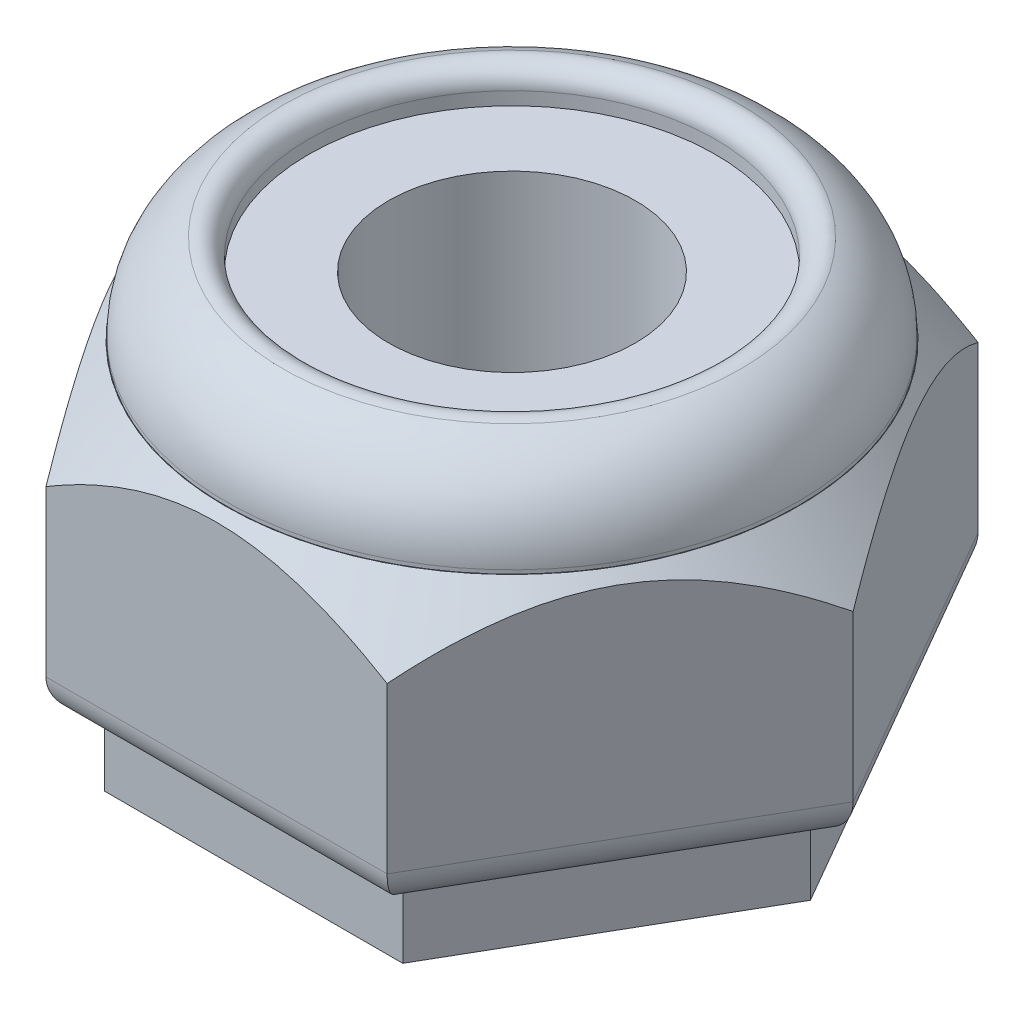
ISO-10303-21;
HEADER;
FILE_DESCRIPTION(('STEP AP214'),'2;1');
FILE_NAME('part.step','',(''),(''),'','','');
FILE_SCHEMA(('AUTOMOTIVE_DESIGN { 1 0 10303 214 1 1 1 1 }'));
ENDSEC;
DATA;
#1=APPLICATION_CONTEXT('core data for automotive mechanical design processes');
#2=APPLICATION_PROTOCOL_DEFINITION('international standard','automotive_design',2000,#1);
#3=PRODUCT_CONTEXT('',#1,'mechanical');
#4=PRODUCT('Part','Part','',(#3));
#5=PRODUCT_RELATED_PRODUCT_CATEGORY('part','',(#4));
#6=PRODUCT_DEFINITION_FORMATION('','',#4);
#7=PRODUCT_DEFINITION_CONTEXT('part definition',#1,'design');
#8=PRODUCT_DEFINITION('design','',#6,#7);
#9=PRODUCT_DEFINITION_SHAPE('','',#8);
#10=(LENGTH_UNIT() NAMED_UNIT(*) SI_UNIT(.MILLI.,.METRE.));
#11=(NAMED_UNIT(*) PLANE_ANGLE_UNIT() SI_UNIT($,.RADIAN.));
#12=(NAMED_UNIT(*) SI_UNIT($,.STERADIAN.) SOLID_ANGLE_UNIT());
#13=UNCERTAINTY_MEASURE_WITH_UNIT(LENGTH_MEASURE(1.E-05),#10,'distance_accuracy_value','');
#14=(GEOMETRIC_REPRESENTATION_CONTEXT(3) GLOBAL_UNCERTAINTY_ASSIGNED_CONTEXT((#13)) GLOBAL_UNIT_ASSIGNED_CONTEXT((#10,
#11,#12)) REPRESENTATION_CONTEXT('',''));
#15=CARTESIAN_POINT('',(0.,0.,0.));
#16=DIRECTION('',(0.,0.,1.));
#17=DIRECTION('',(1.,0.,0.));
#18=AXIS2_PLACEMENT_3D('',#15,#16,#17);
#19=CARTESIAN_POINT('',(0.,4.97840000000001,0.));
#20=DIRECTION('',(0.,-1.,0.));
#21=DIRECTION('',(1.,0.,0.));
#22=AXIS2_PLACEMENT_3D('',#19,#20,#21);
#23=CYLINDRICAL_SURFACE('',#22,3.93700000000001);
#24=CARTESIAN_POINT('',(0.,3.7084,0.));
#25=DIRECTION('',(0.,1.,0.));
#26=DIRECTION('',(-1.,0.,0.));
#27=AXIS2_PLACEMENT_3D('',#24,#25,#26);
#28=CIRCLE('',#27,3.937);
#29=CARTESIAN_POINT('',(-3.937,3.7084,0.));
#30=VERTEX_POINT('',#29);
#31=EDGE_CURVE('E142',#30,#30,#28,.T.);
#32=ORIENTED_EDGE('',*,*,#31,.F.);
#33=EDGE_LOOP('',(#32));
#34=FACE_BOUND('',#33,.T.);
#35=CARTESIAN_POINT('',(0.,3.6576,0.));
#36=DIRECTION('',(0.,-1.,0.));
#37=DIRECTION('',(1.,0.,0.));
#38=AXIS2_PLACEMENT_3D('',#35,#36,#37);
#39=CIRCLE('',#38,3.93700000000001);
#40=CARTESIAN_POINT('',(3.93700000000001,3.6576,0.));
#41=VERTEX_POINT('',#40);
#42=EDGE_CURVE('E20',#41,#41,#39,.F.);
#43=ORIENTED_EDGE('',*,*,#42,.T.);
#44=EDGE_LOOP('',(#43));
#45=FACE_BOUND('',#44,.T.);
#46=ADVANCED_FACE('F16',(#34,#45),#23,.T.);
#47=CARTESIAN_POINT('',(2.34315000000001,3.6576,4.05845484975502));
#48=DIRECTION('',(0.,-1.,0.));
#49=DIRECTION('',(1.,0.,0.));
#50=AXIS2_PLACEMENT_3D('',#47,#48,#49);
#51=PLANE('',#50);
#52=CARTESIAN_POINT('',(0.,3.65760000016735,0.));
#53=DIRECTION('',(0.,-1.,0.));
#54=DIRECTION('',(0.,0.,-1.));
#55=AXIS2_PLACEMENT_3D('',#52,#53,#54);
#56=CIRCLE('',#55,3.94407100938664);
#57=CARTESIAN_POINT('',(0.,3.65760000016735,-3.94407100938664));
#58=VERTEX_POINT('',#57);
#59=EDGE_CURVE('E141',#58,#58,#56,.T.);
#60=ORIENTED_EDGE('',*,*,#59,.F.);
#61=EDGE_LOOP('',(#60));
#62=FACE_BOUND('',#61,.T.);
#63=ORIENTED_EDGE('',*,*,#42,.F.);
#64=EDGE_LOOP('',(#63));
#65=FACE_BOUND('',#64,.T.);
#66=ADVANCED_FACE('F198',(#62,#65),#51,.F.);
#67=CARTESIAN_POINT('',(0.,3.70840000000008,0.));
#68=DIRECTION('',(0.,1.,0.));
#69=DIRECTION('',(0.,0.,1.));
#70=AXIS2_PLACEMENT_3D('',#67,#68,#69);
#71=TOROIDAL_SURFACE('',#70,2.66699999999999,1.27000000000001);
#72=ORIENTED_EDGE('',*,*,#31,.T.);
#73=EDGE_LOOP('',(#72));
#74=FACE_BOUND('',#73,.T.);
#75=CARTESIAN_POINT('',(0.,4.88572150982652,0.));
#76=DIRECTION('',(0.,1.,0.));
#77=DIRECTION('',(-1.,0.,0.));
#78=AXIS2_PLACEMENT_3D('',#75,#76,#77);
#79=CIRCLE('',#78,3.14325000000004);
#80=CARTESIAN_POINT('',(-3.14325000000003,4.88572150982652,0.));
#81=VERTEX_POINT('',#80);
#82=EDGE_CURVE('E121',#81,#81,#79,.T.);
#83=ORIENTED_EDGE('',*,*,#82,.F.);
#84=EDGE_LOOP('',(#83));
#85=FACE_BOUND('',#84,.T.);
#86=ADVANCED_FACE('F195',(#74,#85),#71,.T.);
#87=CARTESIAN_POINT('',(0.,2.76773860986168,0.));
#88=DIRECTION('',(0.,-1.,0.));
#89=DIRECTION('',(0.,0.,-1.));
#90=AXIS2_PLACEMENT_3D('',#87,#88,#89);
#91=CONICAL_SURFACE('',#90,4.69075337383629,0.698131700827581);
#92=CARTESIAN_POINT('',(-4.68630000002063,2.77304593408968,-5.5851817155357E-11));
#93=CARTESIAN_POINT('',(-4.65177717141987,2.81418235899122,0.0597952931143583));
#94=CARTESIAN_POINT('',(-4.61695780288894,2.85432113120693,0.120104208502788));
#95=CARTESIAN_POINT('',(-4.54666264441,2.93230661030783,0.241858994518482));
#96=CARTESIAN_POINT('',(-4.51118655193937,2.9701522247184,0.303305389130307));
#97=CARTESIAN_POINT('',(-4.40329561884235,3.0801870150985,0.490177966928205));
#98=CARTESIAN_POINT('',(-4.32983334003035,3.14837015585763,0.617418366271436));
#99=CARTESIAN_POINT('',(-4.17977964995295,3.27092778618679,0.877318981349457));
#100=CARTESIAN_POINT('',(-4.10317943930135,3.32525984895606,1.00999443806823));
#101=CARTESIAN_POINT('',(-3.94747591648453,3.41577217654512,1.2796808505042));
#102=CARTESIAN_POINT('',(-3.86837998240626,3.45200143021415,1.41667902699998));
#103=CARTESIAN_POINT('',(-3.73746585192525,3.49372811251008,1.64342895242181));
#104=CARTESIAN_POINT('',(-3.68614686015525,3.50560413722607,1.73231605356066));
#105=CARTESIAN_POINT('',(-3.58316406703978,3.52008140709636,1.910687483542));
#106=CARTESIAN_POINT('',(-3.53150020829175,3.52268106759616,2.00017191180866));
#107=CARTESIAN_POINT('',(-3.4285503454563,3.51847006530652,2.1784863048719));
#108=CARTESIAN_POINT('',(-3.37726380879505,3.51171021123823,2.26731719211343));
#109=CARTESIAN_POINT('',(-3.27519197702569,3.48921023560211,2.44411079075957));
#110=CARTESIAN_POINT('',(-3.224406707084,3.47346966546141,2.53207345857468));
#111=CARTESIAN_POINT('',(-3.10963060126893,3.42817062225528,2.73087150534129));
#112=CARTESIAN_POINT('',(-3.04589899568911,3.39598542078789,2.84125788425347));
#113=CARTESIAN_POINT('',(-2.92018166730183,3.32004827847368,3.05900668441208));
#114=CARTESIAN_POINT('',(-2.85819691952129,3.27629001415344,3.16636741686231));
#115=CARTESIAN_POINT('',(-2.7358890681865,3.1791036138555,3.37821082953874));
#116=CARTESIAN_POINT('',(-2.67557364726428,3.12563730729643,3.48268020305593));
#117=CARTESIAN_POINT('',(-2.55683004307658,3.01104764605198,3.68835015858288));
#118=CARTESIAN_POINT('',(-2.49840123076285,2.94992687744367,3.78955183013616));
#119=CARTESIAN_POINT('',(-2.42439626080902,2.86741854621722,3.91773219810881));
#120=CARTESIAN_POINT('',(-2.40802320097242,2.84883596647861,3.94609116962116));
#121=CARTESIAN_POINT('',(-2.3754621575828,2.81125673911825,4.00248855111944));
#122=CARTESIAN_POINT('',(-2.35927376439136,2.7922615116873,4.03052767061991));
#123=CARTESIAN_POINT('',(-2.34314999996957,2.77304593409365,4.05845484980773));
#124=B_SPLINE_CURVE_WITH_KNOTS('',3,(#92,#93,#94,#95,#96,#97,#98,#99,#100,#101,#102,#103,#104,
#105,#106,#107,#108,#109,#110,#111,#112,#113,#114,#115,#116,#117,#118,#119,#120,#121,#122,#123),
.UNSPECIFIED.,.F.,.F.,(4,2,2,2,2,2,2,2,2,2,2,2,2,2,2,4),(0.,0.241096809096306,0.482307589468028,
0.967637153878541,1.45443592247298,1.93991010962832,2.24950193441283,2.55914664334294,
2.86711700082692,3.17510274230014,3.56882084728694,3.96275452424868,4.35827201956431,
4.75365624709085,4.86660838996671,4.97921936903169),.UNSPECIFIED.);
#125=CARTESIAN_POINT('',(-4.68630000003129,2.77304593409263,1.36258849487727E-12));
#126=VERTEX_POINT('',#125);
#127=CARTESIAN_POINT('',(-2.34314999998476,2.77304593411176,4.05845484978141));
#128=VERTEX_POINT('',#127);
#129=EDGE_CURVE('E107',#126,#128,#124,.T.);
#130=ORIENTED_EDGE('',*,*,#129,.T.);
#131=CARTESIAN_POINT('',(-2.34315000006155,2.77304593408735,4.0584548497437));
#132=CARTESIAN_POINT('',(-2.27415972170866,2.81414935281164,4.05845484975083));
#133=CARTESIAN_POINT('',(-2.20457738522182,2.85425669894478,4.05845484975385));
#134=CARTESIAN_POINT('',(-2.06410193527611,2.93218331977878,4.05845484975614));
#135=CARTESIAN_POINT('',(-1.99320821640363,2.9700015014107,4.05845484975539));
#136=CARTESIAN_POINT('',(-1.77754688770714,3.07999086395974,4.05845484975419));
#137=CARTESIAN_POINT('',(-1.63068545867608,3.14815894046428,4.05845484975478));
#138=CARTESIAN_POINT('',(-1.3305275245436,3.27077676928304,4.05845484975521));
#139=CARTESIAN_POINT('',(-1.17720631605115,3.32516696813021,4.05845484975505));
#140=CARTESIAN_POINT('',(-0.86561350375334,3.41574608774384,4.05845484975494));
#141=CARTESIAN_POINT('',(-0.707359229251527,3.45199244882939,4.05845484975499));
#142=CARTESIAN_POINT('',(-0.456822143289689,3.49192146554132,4.058454849755));
#143=CARTESIAN_POINT('',(-0.365672921111748,3.50290887302486,4.058454849755));
#144=CARTESIAN_POINT('',(-0.183016321982132,3.51758027920227,4.058454849755));
#145=CARTESIAN_POINT('',(-0.0915105175139071,3.52128341043631,4.058454849755));
#146=CARTESIAN_POINT('',(0.104649468639837,3.52128177498356,4.058454849755));
#147=CARTESIAN_POINT('',(0.209305100868819,3.51643705340132,4.058454849755));
#148=CARTESIAN_POINT('',(0.417787181903716,3.49730239566766,4.058454849755));
#149=CARTESIAN_POINT('',(0.521613181345373,3.48300765118378,4.058454849755));
#150=CARTESIAN_POINT('',(0.728332544903489,3.44553375893286,4.058454849755));
#151=CARTESIAN_POINT('',(0.831215331547278,3.4222969773141,4.058454849755));
#152=CARTESIAN_POINT('',(1.03487580389782,3.36791830062304,4.058454849755));
#153=CARTESIAN_POINT('',(1.13565289467374,3.33677420329568,4.058454849755));
#154=CARTESIAN_POINT('',(1.33273383820815,3.26838741926302,4.058454849755));
#155=CARTESIAN_POINT('',(1.42908716224858,3.23128582693013,4.058454849755));
#156=CARTESIAN_POINT('',(1.61947291707491,3.15151071600647,4.058454849755));
#157=CARTESIAN_POINT('',(1.71350470709176,3.10883567908223,4.058454849755));
#158=CARTESIAN_POINT('',(1.89803195382149,3.01941532340772,4.058454849755));
#159=CARTESIAN_POINT('',(1.98855798046384,2.9727325573531,4.058454849755));
#160=CARTESIAN_POINT('',(2.16742834958516,2.87556944094008,4.058454849755));
#161=CARTESIAN_POINT('',(2.25577492893011,2.8250932194195,4.058454849755));
#162=CARTESIAN_POINT('',(2.34315000006327,2.77304593409223,4.058454849755));
#163=B_SPLINE_CURVE_WITH_KNOTS('',3,(#131,#132,#133,#134,#135,#136,#137,#138,#139,#140,#141,
#142,#143,#144,#145,#146,#147,#148,#149,#150,#151,#152,#153,#154,#155,#156,#157,#158,#159,#160,
#161,#162),.UNSPECIFIED.,.F.,.F.,(4,2,2,2,2,2,2,2,2,2,2,2,2,2,2,4),(0.,0.240903303567016,
0.481920744751272,0.967059466998938,1.45426068379578,1.93990959183257,2.21507934698528,
2.48952538388813,2.80337599595386,3.11738642358903,3.43345557970446,3.74961286053018,
4.05916118105052,4.36879400618447,4.67425708544416,4.97939238066899),.UNSPECIFIED.);
#164=CARTESIAN_POINT('',(2.34315000001685,2.77304593409264,4.05845484978141));
#165=VERTEX_POINT('',#164);
#166=EDGE_CURVE('E175',#128,#165,#163,.T.);
#167=ORIENTED_EDGE('',*,*,#166,.T.);
#168=CARTESIAN_POINT('',(2.34314999996197,2.77304593408969,4.05845484980079));
#169=CARTESIAN_POINT('',(2.37767282857373,2.81418235899124,3.99865955663693));
#170=CARTESIAN_POINT('',(2.41249219710932,2.85432113120694,3.93835064125119));
#171=CARTESIAN_POINT('',(2.48278735559178,2.93230661030784,3.81659585523753));
#172=CARTESIAN_POINT('',(2.51826344806127,2.97015222471841,3.75514946062505));
#173=CARTESIAN_POINT('',(2.62615438115643,3.0801870150985,3.56827688282608));
#174=CARTESIAN_POINT('',(2.69961665996934,3.14837015585764,3.44103648348338));
#175=CARTESIAN_POINT('',(2.8496703500474,3.27092778618679,3.18113586840574));
#176=CARTESIAN_POINT('',(2.92627056069876,3.32525984895606,3.04846041168683));
#177=CARTESIAN_POINT('',(3.08197408351539,3.41577217654512,2.77877399925076));
#178=CARTESIAN_POINT('',(3.16107001759374,3.45200143021415,2.64177582275502));
#179=CARTESIAN_POINT('',(3.29198414807477,3.49372811251008,2.4150258973332));
#180=CARTESIAN_POINT('',(3.34330313984477,3.50560413722607,2.32613879619435));
#181=CARTESIAN_POINT('',(3.44628593296023,3.52008140709636,2.147767366213));
#182=CARTESIAN_POINT('',(3.49794979170827,3.52268106759615,2.05828293794635));
#183=CARTESIAN_POINT('',(3.60089965454371,3.51847006530651,1.87996854488311));
#184=CARTESIAN_POINT('',(3.65218619120497,3.51171021123823,1.79113765764158));
#185=CARTESIAN_POINT('',(3.75425802297432,3.48921023560211,1.61434405899544));
#186=CARTESIAN_POINT('',(3.80504329291601,3.47346966546141,1.52638139118033));
#187=CARTESIAN_POINT('',(3.91981939873108,3.42817062225528,1.32758334441373));
#188=CARTESIAN_POINT('',(3.98355100431089,3.39598542078789,1.21719696550155));
#189=CARTESIAN_POINT('',(4.10926833269818,3.32004827847368,0.999448165342945));
#190=CARTESIAN_POINT('',(4.17125308047872,3.27629001415344,0.892087432892712));
#191=CARTESIAN_POINT('',(4.2935609318135,3.17910361385551,0.680244020216284));
#192=CARTESIAN_POINT('',(4.35387635273573,3.12563730729643,0.575774646699087));
#193=CARTESIAN_POINT('',(4.47261995692343,3.01104764605197,0.370104691172138));
#194=CARTESIAN_POINT('',(4.53104876923716,2.94992687744367,0.268903019618855));
#195=CARTESIAN_POINT('',(4.60505373919152,2.86741854621663,0.14072265164529));
#196=CARTESIAN_POINT('',(4.62142679902863,2.84883596647742,0.112363680132042));
#197=CARTESIAN_POINT('',(4.65398784241929,2.81125673911583,0.055966298631973));
#198=CARTESIAN_POINT('',(4.67017623561123,2.79226151168425,0.0279271791306273));
#199=CARTESIAN_POINT('',(4.68630000003353,2.77304593408996,-5.80666998558344E-11));
#200=B_SPLINE_CURVE_WITH_KNOTS('',3,(#168,#169,#170,#171,#172,#173,#174,#175,#176,#177,#178,
#179,#180,#181,#182,#183,#184,#185,#186,#187,#188,#189,#190,#191,#192,#193,#194,#195,#196,#197,
#198,#199),.UNSPECIFIED.,.F.,.F.,(4,2,2,2,2,2,2,2,2,2,2,2,2,2,2,4),(0.,0.241096809096303,
0.482307589468021,0.967637153878527,1.45443592247296,1.9399101096283,2.24950193441281,
2.55914664334292,2.8671170008269,3.17510274230012,3.56882084728691,3.96275452424864,
4.35827201956428,4.75365624709083,4.86660838997029,4.97921936903886),.UNSPECIFIED.);
#201=CARTESIAN_POINT('',(4.68630000002732,2.77304593409736,-1.0917840877275E-11));
#202=VERTEX_POINT('',#201);
#203=EDGE_CURVE('E182',#165,#202,#200,.T.);
#204=ORIENTED_EDGE('',*,*,#203,.T.);
#205=CARTESIAN_POINT('',(4.68630000001692,2.77304593410323,3.76267458844408E-11));
#206=CARTESIAN_POINT('',(4.65177717141278,2.8141823590028,-0.0597952931310414));
#207=CARTESIAN_POINT('',(4.61695780288054,2.85432113121737,-0.120104208518577));
#208=CARTESIAN_POINT('',(4.54666264440093,2.93230661031677,-0.241858994533079));
#209=CARTESIAN_POINT('',(4.51118655193091,2.97015222472698,-0.303305389144605));
#210=CARTESIAN_POINT('',(4.40329561883524,3.08018701510582,-0.490177966941427));
#211=CARTESIAN_POINT('',(4.32983334002344,3.14837015586387,-0.617418366283689));
#212=CARTESIAN_POINT('',(4.17977964994688,3.27092778619112,-0.877318981359809));
#213=CARTESIAN_POINT('',(4.10317943929591,3.32525984895958,-1.00999443807765));
#214=CARTESIAN_POINT('',(3.94747591648032,3.41577217654717,-1.27968085051162));
#215=CARTESIAN_POINT('',(3.86837998240263,3.45200143021556,-1.41667902700633));
#216=CARTESIAN_POINT('',(3.73746585192226,3.49372811251083,-1.64342895242706));
#217=CARTESIAN_POINT('',(3.68614686015226,3.50560413722664,-1.7323160535659));
#218=CARTESIAN_POINT('',(3.58316406703681,3.52008140709656,-1.91068748354721));
#219=CARTESIAN_POINT('',(3.53150020828879,3.52268106759618,-2.00017191181384));
#220=CARTESIAN_POINT('',(3.42855034545338,3.51847006530618,-2.17848630487702));
#221=CARTESIAN_POINT('',(3.37726380879215,3.51171021123772,-2.26731719211852));
#222=CARTESIAN_POINT('',(3.27519197702284,3.48921023560127,-2.44411079076458));
#223=CARTESIAN_POINT('',(3.22440670708118,3.47346966546041,-2.53207345857964));
#224=CARTESIAN_POINT('',(3.10963060126602,3.42817062225387,-2.73087150534641));
#225=CARTESIAN_POINT('',(3.04589899568608,3.39598542078622,-2.84125788425879));
#226=CARTESIAN_POINT('',(2.92018166729857,3.32004827847145,-3.05900668441778));
#227=CARTESIAN_POINT('',(2.85819691951793,3.27629001415092,-3.1663674168682));
#228=CARTESIAN_POINT('',(2.73588906818295,3.17910361385241,-3.37821082954497));
#229=CARTESIAN_POINT('',(2.67557364726063,3.12563730729304,-3.48268020306233));
#230=CARTESIAN_POINT('',(2.55683004307275,3.01104764604801,-3.68835015858959));
#231=CARTESIAN_POINT('',(2.49840123075893,2.94992687743942,-3.78955183014302));
#232=CARTESIAN_POINT('',(2.42439626080543,2.8674185462131,-3.91773219811509));
#233=CARTESIAN_POINT('',(2.40802320096925,2.84883596647492,-3.94609116962672));
#234=CARTESIAN_POINT('',(2.37546215758045,2.81125673911543,-4.00248855112358));
#235=CARTESIAN_POINT('',(2.35927376438942,2.79226151168493,-4.03052767062335));
#236=CARTESIAN_POINT('',(2.34314999996803,2.77304593409174,-4.05845484981047));
#237=B_SPLINE_CURVE_WITH_KNOTS('',3,(#205,#206,#207,#208,#209,#210,#211,#212,#213,#214,#215,
#216,#217,#218,#219,#220,#221,#222,#223,#224,#225,#226,#227,#228,#229,#230,#231,#232,#233,#234,
#235,#236),.UNSPECIFIED.,.F.,.F.,(4,2,2,2,2,2,2,2,2,2,2,2,2,2,2,4),(0.,0.241096809094276,
0.482307589464009,0.967637153870556,1.45443592246103,1.93991010961239,2.2495019343968,
2.55914664332681,2.86711700081071,3.17510274228384,3.56882084727151,3.96275452423413,
4.35827201955063,4.75365624707804,4.86660838995109,4.97921936901329),.UNSPECIFIED.);
#238=CARTESIAN_POINT('',(2.34315000001448,2.77304593409259,-4.05845484978282));
#239=VERTEX_POINT('',#238);
#240=EDGE_CURVE('E202',#202,#239,#237,.T.);
#241=ORIENTED_EDGE('',*,*,#240,.T.);
#242=CARTESIAN_POINT('',(2.34315000005868,2.77304593408962,-4.058454849745));
#243=CARTESIAN_POINT('',(2.2741597217057,2.81414935281353,-4.05845484975135));
#244=CARTESIAN_POINT('',(2.20457738521886,2.85425669894645,-4.05845484975405));
#245=CARTESIAN_POINT('',(2.06410193527325,2.93218331978018,-4.05845484975609));
#246=CARTESIAN_POINT('',(1.99320821640086,2.97000150141205,-4.05845484975542));
#247=CARTESIAN_POINT('',(1.77754688770464,3.07999086396089,-4.05845484975435));
#248=CARTESIAN_POINT('',(1.63068545867372,3.14815894046526,-4.05845484975488));
#249=CARTESIAN_POINT('',(1.33052752454156,3.2707767692837,-4.05845484975526));
#250=CARTESIAN_POINT('',(1.17720631604929,3.32516696813074,-4.05845484975512));
#251=CARTESIAN_POINT('',(0.865613503751842,3.41574608774412,-4.05845484975502));
#252=CARTESIAN_POINT('',(0.707359229250219,3.45199244882957,-4.05845484975506));
#253=CARTESIAN_POINT('',(0.456822143288761,3.49192146554135,-4.05845484975507));
#254=CARTESIAN_POINT('',(0.365672921111005,3.50290887302485,-4.05845484975507));
#255=CARTESIAN_POINT('',(0.183016321981762,3.5175802792022,-4.05845484975507));
#256=CARTESIAN_POINT('',(0.0915105175137235,3.52128341043623,-4.05845484975507));
#257=CARTESIAN_POINT('',(-0.104649468639836,3.52128177498348,-4.05845484975507));
#258=CARTESIAN_POINT('',(-0.209305100868819,3.51643705340124,-4.05845484975507));
#259=CARTESIAN_POINT('',(-0.41778718190372,3.49730239566758,-4.05845484975507));
#260=CARTESIAN_POINT('',(-0.521613181345379,3.48300765118369,-4.05845484975507));
#261=CARTESIAN_POINT('',(-0.728332544903499,3.44553375893278,-4.05845484975507));
#262=CARTESIAN_POINT('',(-0.831215331547289,3.42229697731402,-4.05845484975507));
#263=CARTESIAN_POINT('',(-1.03487580389784,3.36791830062295,-4.05845484975507));
#264=CARTESIAN_POINT('',(-1.13565289467376,3.3367742032956,-4.05845484975507));
#265=CARTESIAN_POINT('',(-1.33273383820816,3.26838741926293,-4.05845484975507));
#266=CARTESIAN_POINT('',(-1.42908716224858,3.23128582693005,-4.05845484975507));
#267=CARTESIAN_POINT('',(-1.61947291707489,3.1515107160064,-4.05845484975507));
#268=CARTESIAN_POINT('',(-1.71350470709174,3.10883567908216,-4.05845484975507));
#269=CARTESIAN_POINT('',(-1.89803195382145,3.01941532340766,-4.05845484975507));
#270=CARTESIAN_POINT('',(-1.9885579804638,2.97273255735305,-4.05845484975507));
#271=CARTESIAN_POINT('',(-2.1674283495851,2.87556944094004,-4.05845484975507));
#272=CARTESIAN_POINT('',(-2.25577492893005,2.82509321941947,-4.05845484975507));
#273=CARTESIAN_POINT('',(-2.3431500000632,2.7730459340922,-4.05845484975507));
#274=B_SPLINE_CURVE_WITH_KNOTS('',3,(#242,#243,#244,#245,#246,#247,#248,#249,#250,#251,#252,
#253,#254,#255,#256,#257,#258,#259,#260,#261,#262,#263,#264,#265,#266,#267,#268,#269,#270,#271,
#272,#273),.UNSPECIFIED.,.F.,.F.,(4,2,2,2,2,2,2,2,2,2,2,2,2,2,2,4),(0.,0.240903303566687,
0.481920744750623,0.967059466997657,1.45426068379387,1.93990959183004,2.21507934698218,
2.48952538388447,2.80337599595021,3.11738642358539,3.43345557970082,3.74961286052654,
4.05916118104685,4.36879400618078,4.67425708544044,4.97939238066524),.UNSPECIFIED.);
#275=CARTESIAN_POINT('',(-2.34315000001679,2.77304593409261,-4.05845484978147));
#276=VERTEX_POINT('',#275);
#277=EDGE_CURVE('E110',#239,#276,#274,.T.);
#278=ORIENTED_EDGE('',*,*,#277,.T.);
#279=CARTESIAN_POINT('',(-2.34314999996192,2.77304593408966,-4.05845484980084));
#280=CARTESIAN_POINT('',(-2.37767282857368,2.81418235899121,-3.99865955663698));
#281=CARTESIAN_POINT('',(-2.41249219710928,2.85432113120691,-3.93835064125125));
#282=CARTESIAN_POINT('',(-2.48278735559174,2.93230661030781,-3.81659585523759));
#283=CARTESIAN_POINT('',(-2.51826344806123,2.97015222471838,-3.7551494606251));
#284=CARTESIAN_POINT('',(-2.62615438115639,3.08018701509849,-3.56827688282613));
#285=CARTESIAN_POINT('',(-2.6996166599693,3.14837015585762,-3.44103648348342));
#286=CARTESIAN_POINT('',(-2.84967035004737,3.27092778618678,-3.18113586840577));
#287=CARTESIAN_POINT('',(-2.92627056069873,3.32525984895606,-3.04846041168686));
#288=CARTESIAN_POINT('',(-3.08197408351537,3.41577217654512,-2.77877399925078));
#289=CARTESIAN_POINT('',(-3.16107001759372,3.45200143021415,-2.64177582275504));
#290=CARTESIAN_POINT('',(-3.29198414807476,3.49372811251009,-2.41502589733322));
#291=CARTESIAN_POINT('',(-3.34330313984475,3.50560413722608,-2.32613879619437));
#292=CARTESIAN_POINT('',(-3.44628593296022,3.52008140709636,-2.14776736621302));
#293=CARTESIAN_POINT('',(-3.49794979170825,3.52268106759616,-2.05828293794636));
#294=CARTESIAN_POINT('',(-3.6008996545437,3.51847006530652,-1.87996854488312));
#295=CARTESIAN_POINT('',(-3.65218619120495,3.51171021123824,-1.79113765764159));
#296=CARTESIAN_POINT('',(-3.7542580229743,3.48921023560212,-1.61434405899545));
#297=CARTESIAN_POINT('',(-3.80504329291599,3.47346966546142,-1.52638139118034));
#298=CARTESIAN_POINT('',(-3.91981939873106,3.42817062225528,-1.32758334441374));
#299=CARTESIAN_POINT('',(-3.98355100431088,3.3959854207879,-1.21719696550156));
#300=CARTESIAN_POINT('',(-4.10926833269817,3.32004827847369,-0.999448165342954));
#301=CARTESIAN_POINT('',(-4.1712530804787,3.27629001415345,-0.89208743289272));
#302=CARTESIAN_POINT('',(-4.29356093181349,3.17910361385552,-0.680244020216292));
#303=CARTESIAN_POINT('',(-4.35387635273571,3.12563730729644,-0.575774646699097));
#304=CARTESIAN_POINT('',(-4.47261995692341,3.01104764605199,-0.370104691172152));
#305=CARTESIAN_POINT('',(-4.53104876923714,2.94992687744368,-0.26890301961887));
#306=CARTESIAN_POINT('',(-4.60505373919125,2.86741854621693,-0.14072265164575));
#307=CARTESIAN_POINT('',(-4.62142679902811,2.84883596647801,-0.112363680132942));
#308=CARTESIAN_POINT('',(-4.65398784241826,2.81125673911702,-0.0559662986337416));
#309=CARTESIAN_POINT('',(-4.67017623560996,2.79226151168575,-0.0279271791328252));
#310=CARTESIAN_POINT('',(-4.68630000003201,2.77304593409177,5.54427484235605E-11));
#311=B_SPLINE_CURVE_WITH_KNOTS('',3,(#279,#280,#281,#282,#283,#284,#285,#286,#287,#288,#289,
#290,#291,#292,#293,#294,#295,#296,#297,#298,#299,#300,#301,#302,#303,#304,#305,#306,#307,#308,
#309,#310),.UNSPECIFIED.,.F.,.F.,(4,2,2,2,2,2,2,2,2,2,2,2,2,2,2,4),(0.,0.24109680909631,
0.482307589468037,0.967637153878559,1.45443592247301,1.93991010962836,2.24950193441287,
2.55914664334298,2.86711700082697,3.17510274230018,3.56882084728698,3.96275452424871,
4.35827201956434,4.75365624709089,4.86660838996859,4.97921936903541),.UNSPECIFIED.);
#312=EDGE_CURVE('E103',#276,#126,#311,.T.);
#313=ORIENTED_EDGE('',*,*,#312,.T.);
#314=EDGE_LOOP('',(#130,#167,#204,#241,#278,#313));
#315=FACE_BOUND('',#314,.T.);
#316=ORIENTED_EDGE('',*,*,#59,.T.);
#317=EDGE_LOOP('',(#316));
#318=FACE_BOUND('',#317,.T.);
#319=ADVANCED_FACE('F105',(#315,#318),#91,.T.);
#320=CARTESIAN_POINT('',(0.,4.65025720786122,0.));
#321=DIRECTION('',(0.,-1.,0.));
#322=DIRECTION('',(1.,0.,0.));
#323=AXIS2_PLACEMENT_3D('',#320,#321,#322);
#324=TOROIDAL_SURFACE('',#323,3.04800000000006,0.254);
#325=CARTESIAN_POINT('',(0.,4.65025720786115,0.));
#326=DIRECTION('',(0.,1.,0.));
#327=DIRECTION('',(-1.,0.,0.));
#328=AXIS2_PLACEMENT_3D('',#325,#326,#327);
#329=CIRCLE('',#328,2.79400000000001);
#330=CARTESIAN_POINT('',(-2.79400000000001,4.65025720786115,0.));
#331=VERTEX_POINT('',#330);
#332=EDGE_CURVE('E134',#331,#331,#329,.F.);
#333=ORIENTED_EDGE('',*,*,#332,.T.);
#334=EDGE_LOOP('',(#333));
#335=FACE_BOUND('',#334,.T.);
#336=ORIENTED_EDGE('',*,*,#82,.T.);
#337=EDGE_LOOP('',(#336));
#338=FACE_BOUND('',#337,.T.);
#339=ADVANCED_FACE('F18',(#335,#338),#324,.T.);
#340=CARTESIAN_POINT('',(-4.6863,3.6576,0.));
#341=DIRECTION('',(0.866025403784439,0.,-0.5));
#342=DIRECTION('',(-0.5,0.,-0.866025403784439));
#343=AXIS2_PLACEMENT_3D('',#340,#341,#342);
#344=PLANE('',#343);
#345=DIRECTION('',(0.,1.,0.));
#346=VECTOR('',#345,1.);
#347=CARTESIAN_POINT('',(-2.34315,3.6576,4.058454849755));
#348=LINE('',#347,#346);
#349=CARTESIAN_POINT('',(-2.34315000000001,0.507999999999995,4.05845484975499));
#350=VERTEX_POINT('',#349);
#351=EDGE_CURVE('E120',#350,#128,#348,.T.);
#352=ORIENTED_EDGE('',*,*,#351,.T.);
#353=ORIENTED_EDGE('',*,*,#129,.F.);
#354=DIRECTION('',(0.,1.,0.));
#355=VECTOR('',#354,1.);
#356=CARTESIAN_POINT('',(-4.6863000000071,3.6576,1.22922505507717E-11));
#357=LINE('',#356,#355);
#358=CARTESIAN_POINT('',(-4.68630000000355,0.507999999999995,6.14200530713038E-12));
#359=VERTEX_POINT('',#358);
#360=EDGE_CURVE('E114',#126,#359,#357,.F.);
#361=ORIENTED_EDGE('',*,*,#360,.T.);
#362=DIRECTION('',(-0.5,0.,-0.866025403784439));
#363=VECTOR('',#362,1.);
#364=CARTESIAN_POINT('',(-4.68630000000001,0.507999999999995,0.));
#365=LINE('',#364,#363);
#366=EDGE_CURVE('E137',#350,#359,#365,.T.);
#367=ORIENTED_EDGE('',*,*,#366,.F.);
#368=EDGE_LOOP('',(#352,#353,#361,#367));
#369=FACE_BOUND('',#368,.T.);
#370=ADVANCED_FACE('F117',(#369),#344,.F.);
#371=CARTESIAN_POINT('',(-2.34315,3.6576,-4.05845484975501));
#372=DIRECTION('',(0.866025403784439,0.,0.5));
#373=DIRECTION('',(0.5,0.,-0.866025403784439));
#374=AXIS2_PLACEMENT_3D('',#371,#372,#373);
#375=PLANE('',#374);
#376=ORIENTED_EDGE('',*,*,#360,.F.);
#377=ORIENTED_EDGE('',*,*,#312,.F.);
#378=DIRECTION('',(0.,1.,0.));
#379=VECTOR('',#378,1.);
#380=CARTESIAN_POINT('',(-2.34315000001417,3.6576,-4.05845484975507));
#381=LINE('',#380,#379);
#382=CARTESIAN_POINT('',(-2.34315000000708,0.507999999999994,-4.05845484975504));
#383=VERTEX_POINT('',#382);
#384=EDGE_CURVE('E129',#276,#383,#381,.F.);
#385=ORIENTED_EDGE('',*,*,#384,.T.);
#386=DIRECTION('',(0.5,0.,-0.866025403784439));
#387=VECTOR('',#386,1.);
#388=CARTESIAN_POINT('',(-2.34315,0.507999999999995,-4.05845484975502));
#389=LINE('',#388,#387);
#390=EDGE_CURVE('E126',#359,#383,#389,.T.);
#391=ORIENTED_EDGE('',*,*,#390,.F.);
#392=EDGE_LOOP('',(#376,#377,#385,#391));
#393=FACE_BOUND('',#392,.T.);
#394=ADVANCED_FACE('F124',(#393),#375,.F.);
#395=CARTESIAN_POINT('',(2.34315000000001,3.6576,-4.05845484975507));
#396=DIRECTION('',(0.,0.,1.));
#397=DIRECTION('',(1.,0.,0.));
#398=AXIS2_PLACEMENT_3D('',#395,#396,#397);
#399=PLANE('',#398);
#400=ORIENTED_EDGE('',*,*,#384,.F.);
#401=ORIENTED_EDGE('',*,*,#277,.F.);
#402=DIRECTION('',(0.,1.,0.));
#403=VECTOR('',#402,1.);
#404=CARTESIAN_POINT('',(2.34314999999293,3.6576,-4.05845484976733));
#405=LINE('',#404,#403);
#406=CARTESIAN_POINT('',(2.34314999999648,0.507999999999995,-4.05845484976118));
#407=VERTEX_POINT('',#406);
#408=EDGE_CURVE('E510',#239,#407,#405,.F.);
#409=ORIENTED_EDGE('',*,*,#408,.T.);
#410=DIRECTION('',(1.,0.,0.));
#411=VECTOR('',#410,1.);
#412=CARTESIAN_POINT('',(2.34315,0.507999999999994,-4.05845484975503));
#413=LINE('',#412,#411);
#414=EDGE_CURVE('E169',#383,#407,#413,.T.);
#415=ORIENTED_EDGE('',*,*,#414,.F.);
#416=EDGE_LOOP('',(#400,#401,#409,#415));
#417=FACE_BOUND('',#416,.T.);
#418=ADVANCED_FACE('F342',(#417),#399,.F.);
#419=CARTESIAN_POINT('',(4.68630000000002,3.6576,0.));
#420=DIRECTION('',(-0.866025403784439,0.,0.5));
#421=DIRECTION('',(0.5,0.,0.866025403784439));
#422=AXIS2_PLACEMENT_3D('',#419,#420,#421);
#423=PLANE('',#422);
#424=ORIENTED_EDGE('',*,*,#408,.F.);
#425=ORIENTED_EDGE('',*,*,#240,.F.);
#426=DIRECTION('',(0.,1.,0.));
#427=VECTOR('',#426,1.);
#428=CARTESIAN_POINT('',(4.68630000001422,3.6576,-2.46174608475869E-11));
#429=LINE('',#428,#427);
#430=CARTESIAN_POINT('',(4.68630000000712,0.508000000000008,-1.23196537606812E-11));
#431=VERTEX_POINT('',#430);
#432=EDGE_CURVE('E502',#202,#431,#429,.F.);
#433=ORIENTED_EDGE('',*,*,#432,.T.);
#434=DIRECTION('',(0.5,0.,0.866025403784439));
#435=VECTOR('',#434,1.);
#436=CARTESIAN_POINT('',(4.68630000000002,0.507999999999995,0.));
#437=LINE('',#436,#435);
#438=EDGE_CURVE('E165',#407,#431,#437,.T.);
#439=ORIENTED_EDGE('',*,*,#438,.F.);
#440=EDGE_LOOP('',(#424,#425,#433,#439));
#441=FACE_BOUND('',#440,.T.);
#442=ADVANCED_FACE('F348',(#441),#423,.F.);
#443=CARTESIAN_POINT('',(2.34315000000001,3.6576,4.05845484975502));
#444=DIRECTION('',(-0.866025403784439,0.,-0.499999999999999));
#445=DIRECTION('',(-0.499999999999999,0.,0.866025403784439));
#446=AXIS2_PLACEMENT_3D('',#443,#444,#445);
#447=PLANE('',#446);
#448=ORIENTED_EDGE('',*,*,#432,.F.);
#449=ORIENTED_EDGE('',*,*,#203,.F.);
#450=DIRECTION('',(0.,1.,0.));
#451=VECTOR('',#450,1.);
#452=CARTESIAN_POINT('',(2.34315000001423,3.6576,4.058454849755));
#453=LINE('',#452,#451);
#454=CARTESIAN_POINT('',(2.34315000000713,0.507999999999995,4.05845484975499));
#455=VERTEX_POINT('',#454);
#456=EDGE_CURVE('E138',#165,#455,#453,.F.);
#457=ORIENTED_EDGE('',*,*,#456,.T.);
#458=DIRECTION('',(-0.499999999999999,0.,0.866025403784439));
#459=VECTOR('',#458,1.);
#460=CARTESIAN_POINT('',(2.34315000000003,0.508000000000008,4.05845484975498));
#461=LINE('',#460,#459);
#462=EDGE_CURVE('E161',#431,#455,#461,.T.);
#463=ORIENTED_EDGE('',*,*,#462,.F.);
#464=EDGE_LOOP('',(#448,#449,#457,#463));
#465=FACE_BOUND('',#464,.T.);
#466=ADVANCED_FACE('F302',(#465),#447,.F.);
#467=CARTESIAN_POINT('',(-2.34315000000002,3.6576,4.058454849755));
#468=DIRECTION('',(0.,0.,-1.));
#469=DIRECTION('',(-1.,0.,0.));
#470=AXIS2_PLACEMENT_3D('',#467,#468,#469);
#471=PLANE('',#470);
#472=ORIENTED_EDGE('',*,*,#456,.F.);
#473=ORIENTED_EDGE('',*,*,#166,.F.);
#474=ORIENTED_EDGE('',*,*,#351,.F.);
#475=DIRECTION('',(-1.,0.,0.));
#476=VECTOR('',#475,1.);
#477=CARTESIAN_POINT('',(-2.34315,0.507999999999995,4.05845484975498));
#478=LINE('',#477,#476);
#479=EDGE_CURVE('E157',#455,#350,#478,.T.);
#480=ORIENTED_EDGE('',*,*,#479,.F.);
#481=EDGE_LOOP('',(#472,#473,#474,#480));
#482=FACE_BOUND('',#481,.T.);
#483=ADVANCED_FACE('F188',(#482),#471,.F.);
#484=CARTESIAN_POINT('',(0.,4.4704,0.));
#485=DIRECTION('',(0.,1.,0.));
#486=DIRECTION('',(-1.,0.,0.));
#487=AXIS2_PLACEMENT_3D('',#484,#485,#486);
#488=CYLINDRICAL_SURFACE('',#487,2.79400000000001);
#489=ORIENTED_EDGE('',*,*,#332,.F.);
#490=EDGE_LOOP('',(#489));
#491=FACE_BOUND('',#490,.T.);
#492=CARTESIAN_POINT('',(0.,4.4704,0.));
#493=DIRECTION('',(0.,1.,0.));
#494=DIRECTION('',(-1.,0.,0.));
#495=AXIS2_PLACEMENT_3D('',#492,#493,#494);
#496=CIRCLE('',#495,2.79400000000001);
#497=CARTESIAN_POINT('',(-2.79400000000001,4.4704,0.));
#498=VERTEX_POINT('',#497);
#499=EDGE_CURVE('E150',#498,#498,#496,.T.);
#500=ORIENTED_EDGE('',*,*,#499,.F.);
#501=EDGE_LOOP('',(#500));
#502=FACE_BOUND('',#501,.T.);
#503=ADVANCED_FACE('F295',(#491,#502),#488,.F.);
#504=CARTESIAN_POINT('',(-4.24635909487751,0.507999999999995,-0.254000000000011));
#505=DIRECTION('',(-0.5,0.,-0.866025403784439));
#506=DIRECTION('',(-0.866025403784439,0.,0.5));
#507=AXIS2_PLACEMENT_3D('',#504,#505,#506);
#508=CYLINDRICAL_SURFACE('',#507,0.508000000000002);
#509=CARTESIAN_POINT('',(-4.09971212650334,0.507999999999995,0.));
#510=DIRECTION('',(0.,0.,-1.));
#511=DIRECTION('',(1.,0.,0.));
#512=AXIS2_PLACEMENT_3D('',#509,#510,#511);
#513=ELLIPSE('',#512,0.586587873496662,0.508000000000002);
#514=CARTESIAN_POINT('',(-4.09971212650335,0.,0.));
#515=VERTEX_POINT('',#514);
#516=EDGE_CURVE('E173',#515,#359,#513,.T.);
#517=ORIENTED_EDGE('',*,*,#516,.F.);
#518=DIRECTION('',(-0.5,0.,-0.866025403784439));
#519=VECTOR('',#518,1.);
#520=CARTESIAN_POINT('',(-2.04985606325168,0.,3.55045484975499));
#521=LINE('',#520,#519);
#522=CARTESIAN_POINT('',(-2.04985606325168,0.,3.55045484975498));
#523=VERTEX_POINT('',#522);
#524=EDGE_CURVE('E153',#515,#523,#521,.F.);
#525=ORIENTED_EDGE('',*,*,#524,.T.);
#526=CARTESIAN_POINT('',(-2.04985606325169,0.507999999999995,3.55045484975498));
#527=DIRECTION('',(-0.866025403784438,0.,-0.5));
#528=DIRECTION('',(-0.5,0.,0.866025403784438));
#529=AXIS2_PLACEMENT_3D('',#526,#527,#528);
#530=ELLIPSE('',#529,0.586587873496662,0.508000000000002);
#531=EDGE_CURVE('E154',#350,#523,#530,.F.);
#532=ORIENTED_EDGE('',*,*,#531,.F.);
#533=ORIENTED_EDGE('',*,*,#366,.T.);
#534=EDGE_LOOP('',(#517,#525,#532,#533));
#535=FACE_BOUND('',#534,.T.);
#536=ADVANCED_FACE('F292',(#535),#508,.T.);
#537=CARTESIAN_POINT('',(-1.9032090948775,0.507999999999995,-3.80445484975502));
#538=DIRECTION('',(0.5,0.,-0.866025403784439));
#539=DIRECTION('',(-0.866025403784439,0.,-0.5));
#540=AXIS2_PLACEMENT_3D('',#537,#538,#539);
#541=CYLINDRICAL_SURFACE('',#540,0.508000000000002);
#542=CARTESIAN_POINT('',(-2.04985606325166,0.508000000000002,-3.55045484975503));
#543=DIRECTION('',(0.866025403784439,0.,-0.5));
#544=DIRECTION('',(0.5,0.,0.866025403784439));
#545=AXIS2_PLACEMENT_3D('',#542,#543,#544);
#546=ELLIPSE('',#545,0.586587873496661,0.508000000000002);
#547=CARTESIAN_POINT('',(-2.04985606325168,0.,-3.55045484975506));
#548=VERTEX_POINT('',#547);
#549=EDGE_CURVE('E170',#548,#383,#546,.T.);
#550=ORIENTED_EDGE('',*,*,#549,.F.);
#551=DIRECTION('',(0.5,0.,-0.866025403784439));
#552=VECTOR('',#551,1.);
#553=CARTESIAN_POINT('',(-4.09971212650335,0.,0.));
#554=LINE('',#553,#552);
#555=EDGE_CURVE('E532',#548,#515,#554,.F.);
#556=ORIENTED_EDGE('',*,*,#555,.T.);
#557=ORIENTED_EDGE('',*,*,#516,.T.);
#558=ORIENTED_EDGE('',*,*,#390,.T.);
#559=EDGE_LOOP('',(#550,#556,#557,#558));
#560=FACE_BOUND('',#559,.T.);
#561=ADVANCED_FACE('F288',(#560),#541,.T.);
#562=CARTESIAN_POINT('',(2.34315,0.508000000000008,-3.55045484975503));
#563=DIRECTION('',(1.,0.,0.));
#564=DIRECTION('',(0.,1.,0.));
#565=AXIS2_PLACEMENT_3D('',#562,#563,#564);
#566=CYLINDRICAL_SURFACE('',#565,0.508000000000002);
#567=CARTESIAN_POINT('',(2.04985606325169,0.508000000000002,-3.55045484975503));
#568=DIRECTION('',(0.866025403784438,0.,0.5));
#569=DIRECTION('',(-0.5,0.,0.866025403784439));
#570=AXIS2_PLACEMENT_3D('',#567,#568,#569);
#571=ELLIPSE('',#570,0.586587873496662,0.508000000000002);
#572=CARTESIAN_POINT('',(2.04985606325168,0.,-3.55045484975508));
#573=VERTEX_POINT('',#572);
#574=EDGE_CURVE('E166',#573,#407,#571,.T.);
#575=ORIENTED_EDGE('',*,*,#574,.F.);
#576=DIRECTION('',(1.,0.,0.));
#577=VECTOR('',#576,1.);
#578=CARTESIAN_POINT('',(-2.04985606325165,0.,-3.55045484975508));
#579=LINE('',#578,#577);
#580=EDGE_CURVE('E521',#573,#548,#579,.F.);
#581=ORIENTED_EDGE('',*,*,#580,.T.);
#582=ORIENTED_EDGE('',*,*,#549,.T.);
#583=ORIENTED_EDGE('',*,*,#414,.T.);
#584=EDGE_LOOP('',(#575,#581,#582,#583));
#585=FACE_BOUND('',#584,.T.);
#586=ADVANCED_FACE('F284',(#585),#566,.T.);
#587=CARTESIAN_POINT('',(4.24635909487753,0.507999999999995,0.253999999999983));
#588=DIRECTION('',(0.5,0.,0.866025403784439));
#589=DIRECTION('',(0.866025403784439,0.,-0.5));
#590=AXIS2_PLACEMENT_3D('',#587,#588,#589);
#591=CYLINDRICAL_SURFACE('',#590,0.508000000000002);
#592=ORIENTED_EDGE('',*,*,#574,.T.);
#593=ORIENTED_EDGE('',*,*,#438,.T.);
#594=CARTESIAN_POINT('',(4.09971212650336,0.508000000000002,0.));
#595=DIRECTION('',(0.,0.,1.));
#596=DIRECTION('',(-1.,0.,0.));
#597=AXIS2_PLACEMENT_3D('',#594,#595,#596);
#598=ELLIPSE('',#597,0.586587873496662,0.508000000000002);
#599=CARTESIAN_POINT('',(4.09971212650335,0.,0.));
#600=VERTEX_POINT('',#599);
#601=EDGE_CURVE('E162',#600,#431,#598,.T.);
#602=ORIENTED_EDGE('',*,*,#601,.F.);
#603=DIRECTION('',(0.5,0.,0.866025403784439));
#604=VECTOR('',#603,1.);
#605=CARTESIAN_POINT('',(2.04985606325167,0.,-3.55045484975502));
#606=LINE('',#605,#604);
#607=EDGE_CURVE('E585',#600,#573,#606,.F.);
#608=ORIENTED_EDGE('',*,*,#607,.T.);
#609=EDGE_LOOP('',(#592,#593,#602,#608));
#610=FACE_BOUND('',#609,.T.);
#611=ADVANCED_FACE('F280',(#610),#591,.T.);
#612=CARTESIAN_POINT('',(1.90320909487753,0.508000000000008,3.80445484975498));
#613=DIRECTION('',(-0.499999999999999,0.,0.866025403784439));
#614=DIRECTION('',(0.866025403784439,0.,0.499999999999999));
#615=AXIS2_PLACEMENT_3D('',#612,#613,#614);
#616=CYLINDRICAL_SURFACE('',#615,0.508000000000002);
#617=ORIENTED_EDGE('',*,*,#601,.T.);
#618=ORIENTED_EDGE('',*,*,#462,.T.);
#619=CARTESIAN_POINT('',(2.0498560632517,0.508000000000002,3.55045484975498));
#620=DIRECTION('',(-0.866025403784439,0.,0.5));
#621=DIRECTION('',(-0.5,0.,-0.866025403784439));
#622=AXIS2_PLACEMENT_3D('',#619,#620,#621);
#623=ELLIPSE('',#622,0.586587873496662,0.508000000000002);
#624=CARTESIAN_POINT('',(2.0498560632517,0.,3.55045484975498));
#625=VERTEX_POINT('',#624);
#626=EDGE_CURVE('E158',#625,#455,#623,.T.);
#627=ORIENTED_EDGE('',*,*,#626,.F.);
#628=DIRECTION('',(-0.499999999999999,0.,0.866025403784439));
#629=VECTOR('',#628,1.);
#630=CARTESIAN_POINT('',(4.09971212650336,0.,0.));
#631=LINE('',#630,#629);
#632=EDGE_CURVE('E561',#625,#600,#631,.F.);
#633=ORIENTED_EDGE('',*,*,#632,.T.);
#634=EDGE_LOOP('',(#617,#618,#627,#633));
#635=FACE_BOUND('',#634,.T.);
#636=ADVANCED_FACE('F276',(#635),#616,.T.);
#637=CARTESIAN_POINT('',(-2.34315,0.507999999999995,3.55045484975498));
#638=DIRECTION('',(-1.,0.,0.));
#639=DIRECTION('',(0.,0.,1.));
#640=AXIS2_PLACEMENT_3D('',#637,#638,#639);
#641=CYLINDRICAL_SURFACE('',#640,0.508000000000002);
#642=ORIENTED_EDGE('',*,*,#531,.T.);
#643=DIRECTION('',(-1.,0.,0.));
#644=VECTOR('',#643,1.);
#645=CARTESIAN_POINT('',(2.04985606325167,0.,3.55045484975498));
#646=LINE('',#645,#644);
#647=EDGE_CURVE('E149',#523,#625,#646,.F.);
#648=ORIENTED_EDGE('',*,*,#647,.T.);
#649=ORIENTED_EDGE('',*,*,#626,.T.);
#650=ORIENTED_EDGE('',*,*,#479,.T.);
#651=EDGE_LOOP('',(#642,#648,#649,#650));
#652=FACE_BOUND('',#651,.T.);
#653=ADVANCED_FACE('F272',(#652),#641,.T.);
#654=CARTESIAN_POINT('',(0.,4.4704,0.));
#655=DIRECTION('',(0.,1.,0.));
#656=DIRECTION('',(-1.,0.,0.));
#657=AXIS2_PLACEMENT_3D('',#654,#655,#656);
#658=PLANE('',#657);
#659=ORIENTED_EDGE('',*,*,#499,.T.);
#660=EDGE_LOOP('',(#659));
#661=FACE_BOUND('',#660,.T.);
#662=CARTESIAN_POINT('',(0.,4.4704,0.));
#663=DIRECTION('',(0.,1.,0.));
#664=DIRECTION('',(-1.,0.,0.));
#665=AXIS2_PLACEMENT_3D('',#662,#663,#664);
#666=CIRCLE('',#665,1.69545000000001);
#667=CARTESIAN_POINT('',(-1.69545000000001,4.4704,0.));
#668=VERTEX_POINT('',#667);
#669=EDGE_CURVE('E145',#668,#668,#666,.F.);
#670=ORIENTED_EDGE('',*,*,#669,.T.);
#671=EDGE_LOOP('',(#670));
#672=FACE_BOUND('',#671,.T.);
#673=ADVANCED_FACE('F268',(#661,#672),#658,.T.);
#674=CARTESIAN_POINT('',(-2.04985606325168,-0.956309999999953,3.55045484975499));
#675=DIRECTION('',(0.866025403784439,0.,-0.5));
#676=DIRECTION('',(-0.5,0.,-0.866025403784439));
#677=AXIS2_PLACEMENT_3D('',#674,#675,#676);
#678=PLANE('',#677);
#679=DIRECTION('',(0.,1.,0.));
#680=VECTOR('',#679,1.);
#681=CARTESIAN_POINT('',(-4.09971212650335,-0.956309999999919,0.));
#682=LINE('',#681,#680);
#683=CARTESIAN_POINT('',(-4.09971212650335,-0.956309999999924,0.));
#684=VERTEX_POINT('',#683);
#685=EDGE_CURVE('E534',#515,#684,#682,.F.);
#686=ORIENTED_EDGE('',*,*,#685,.T.);
#687=DIRECTION('',(-0.500000000000002,0.,-0.866025403784438));
#688=VECTOR('',#687,1.);
#689=CARTESIAN_POINT('',(-2.04985606325168,-0.956309999999919,3.55045484975499));
#690=LINE('',#689,#688);
#691=CARTESIAN_POINT('',(-2.04985606325168,-0.956309999999936,3.55045484975498));
#692=VERTEX_POINT('',#691);
#693=EDGE_CURVE('E148',#692,#684,#690,.T.);
#694=ORIENTED_EDGE('',*,*,#693,.F.);
#695=DIRECTION('',(0.,1.,0.));
#696=VECTOR('',#695,1.);
#697=CARTESIAN_POINT('',(-2.04985606325168,-0.956309999999919,3.55045484975498));
#698=LINE('',#697,#696);
#699=EDGE_CURVE('E557',#692,#523,#698,.T.);
#700=ORIENTED_EDGE('',*,*,#699,.T.);
#701=ORIENTED_EDGE('',*,*,#524,.F.);
#702=EDGE_LOOP('',(#686,#694,#700,#701));
#703=FACE_BOUND('',#702,.T.);
#704=ADVANCED_FACE('F264',(#703),#678,.F.);
#705=CARTESIAN_POINT('',(-4.09971212650335,-0.956309999999919,0.));
#706=DIRECTION('',(0.866025403784439,0.,0.5));
#707=DIRECTION('',(0.5,0.,-0.866025403784439));
#708=AXIS2_PLACEMENT_3D('',#705,#706,#707);
#709=PLANE('',#708);
#710=DIRECTION('',(0.,1.,0.));
#711=VECTOR('',#710,1.);
#712=CARTESIAN_POINT('',(-2.04985606325166,-0.956309999999912,-3.55045484975508));
#713=LINE('',#712,#711);
#714=CARTESIAN_POINT('',(-2.04985606325165,-0.956309999999918,-3.55045484975508));
#715=VERTEX_POINT('',#714);
#716=EDGE_CURVE('E525',#548,#715,#713,.F.);
#717=ORIENTED_EDGE('',*,*,#716,.T.);
#718=DIRECTION('',(0.499999999999997,0.,-0.866025403784441));
#719=VECTOR('',#718,1.);
#720=CARTESIAN_POINT('',(-4.09971212650335,-0.956309999999919,0.));
#721=LINE('',#720,#719);
#722=EDGE_CURVE('E540',#684,#715,#721,.T.);
#723=ORIENTED_EDGE('',*,*,#722,.F.);
#724=ORIENTED_EDGE('',*,*,#685,.F.);
#725=ORIENTED_EDGE('',*,*,#555,.F.);
#726=EDGE_LOOP('',(#717,#723,#724,#725));
#727=FACE_BOUND('',#726,.T.);
#728=ADVANCED_FACE('F260',(#727),#709,.F.);
#729=CARTESIAN_POINT('',(-2.04985606325165,-0.956309999999912,-3.55045484975508));
#730=DIRECTION('',(0.,0.,1.));
#731=DIRECTION('',(1.,0.,0.));
#732=AXIS2_PLACEMENT_3D('',#729,#730,#731);
#733=PLANE('',#732);
#734=DIRECTION('',(0.,1.,0.));
#735=VECTOR('',#734,1.);
#736=CARTESIAN_POINT('',(2.04985606325166,-0.956309999999919,-3.55045484975505));
#737=LINE('',#736,#735);
#738=CARTESIAN_POINT('',(2.04985606325165,-0.956309999999917,-3.55045484975506));
#739=VERTEX_POINT('',#738);
#740=EDGE_CURVE('E524',#573,#739,#737,.F.);
#741=ORIENTED_EDGE('',*,*,#740,.T.);
#742=DIRECTION('',(1.,0.,0.));
#743=VECTOR('',#742,1.);
#744=CARTESIAN_POINT('',(-4.09971212650335,-0.956309999999919,-3.55045484975508));
#745=LINE('',#744,#743);
#746=EDGE_CURVE('E529',#715,#739,#745,.T.);
#747=ORIENTED_EDGE('',*,*,#746,.F.);
#748=ORIENTED_EDGE('',*,*,#716,.F.);
#749=ORIENTED_EDGE('',*,*,#580,.F.);
#750=EDGE_LOOP('',(#741,#747,#748,#749));
#751=FACE_BOUND('',#750,.T.);
#752=ADVANCED_FACE('F256',(#751),#733,.F.);
#753=CARTESIAN_POINT('',(2.04985606325167,-0.956309999999919,-3.55045484975502));
#754=DIRECTION('',(-0.866025403784439,0.,0.5));
#755=DIRECTION('',(0.5,0.,0.866025403784439));
#756=AXIS2_PLACEMENT_3D('',#753,#754,#755);
#757=PLANE('',#756);
#758=DIRECTION('',(0.,1.,0.));
#759=VECTOR('',#758,1.);
#760=CARTESIAN_POINT('',(4.09971212650336,-0.956309999999919,0.));
#761=LINE('',#760,#759);
#762=CARTESIAN_POINT('',(4.09971212650336,-0.956309999999919,0.));
#763=VERTEX_POINT('',#762);
#764=EDGE_CURVE('E565',#600,#763,#761,.F.);
#765=ORIENTED_EDGE('',*,*,#764,.T.);
#766=DIRECTION('',(0.500000000000006,0.,0.866025403784435));
#767=VECTOR('',#766,1.);
#768=CARTESIAN_POINT('',(2.04985606325167,-0.956309999999919,-3.55045484975502));
#769=LINE('',#768,#767);
#770=EDGE_CURVE('E581',#739,#763,#769,.T.);
#771=ORIENTED_EDGE('',*,*,#770,.F.);
#772=ORIENTED_EDGE('',*,*,#740,.F.);
#773=ORIENTED_EDGE('',*,*,#607,.F.);
#774=EDGE_LOOP('',(#765,#771,#772,#773));
#775=FACE_BOUND('',#774,.T.);
#776=ADVANCED_FACE('F253',(#775),#757,.F.);
#777=CARTESIAN_POINT('',(4.09971212650336,-0.956309999999919,0.));
#778=DIRECTION('',(-0.866025403784439,0.,-0.499999999999999));
#779=DIRECTION('',(-0.499999999999999,0.,0.866025403784439));
#780=AXIS2_PLACEMENT_3D('',#777,#778,#779);
#781=PLANE('',#780);
#782=DIRECTION('',(0.,1.,0.));
#783=VECTOR('',#782,1.);
#784=CARTESIAN_POINT('',(2.04985606325171,-0.956309999999919,3.55045484975498));
#785=LINE('',#784,#783);
#786=CARTESIAN_POINT('',(2.0498560632517,-0.956309999999919,3.55045484975498));
#787=VERTEX_POINT('',#786);
#788=EDGE_CURVE('E35',#625,#787,#785,.F.);
#789=ORIENTED_EDGE('',*,*,#788,.T.);
#790=DIRECTION('',(-0.500000000000003,0.,0.866025403784437));
#791=VECTOR('',#790,1.);
#792=CARTESIAN_POINT('',(4.09971212650336,-0.956309999999919,0.));
#793=LINE('',#792,#791);
#794=EDGE_CURVE('E577',#763,#787,#793,.T.);
#795=ORIENTED_EDGE('',*,*,#794,.F.);
#796=ORIENTED_EDGE('',*,*,#764,.F.);
#797=ORIENTED_EDGE('',*,*,#632,.F.);
#798=EDGE_LOOP('',(#789,#795,#796,#797));
#799=FACE_BOUND('',#798,.T.);
#800=ADVANCED_FACE('F249',(#799),#781,.F.);
#801=CARTESIAN_POINT('',(2.04985606325167,-0.956309999999919,3.55045484975498));
#802=DIRECTION('',(0.,0.,-1.));
#803=DIRECTION('',(-1.,0.,0.));
#804=AXIS2_PLACEMENT_3D('',#801,#802,#803);
#805=PLANE('',#804);
#806=ORIENTED_EDGE('',*,*,#699,.F.);
#807=DIRECTION('',(1.,0.,0.));
#808=VECTOR('',#807,1.);
#809=CARTESIAN_POINT('',(-4.09971212650335,-0.956309999999919,3.55045484975498));
#810=LINE('',#809,#808);
#811=EDGE_CURVE('E26',#787,#692,#810,.F.);
#812=ORIENTED_EDGE('',*,*,#811,.F.);
#813=ORIENTED_EDGE('',*,*,#788,.F.);
#814=ORIENTED_EDGE('',*,*,#647,.F.);
#815=EDGE_LOOP('',(#806,#812,#813,#814));
#816=FACE_BOUND('',#815,.T.);
#817=ADVANCED_FACE('F242',(#816),#805,.F.);
#818=CARTESIAN_POINT('',(0.,0.,0.));
#819=DIRECTION('',(0.,1.,0.));
#820=DIRECTION('',(-1.,0.,0.));
#821=AXIS2_PLACEMENT_3D('',#818,#819,#820);
#822=CYLINDRICAL_SURFACE('',#821,1.69545000000001);
#823=CARTESIAN_POINT('',(0.,-0.956309999999919,0.));
#824=DIRECTION('',(0.,1.,0.));
#825=DIRECTION('',(-1.,0.,0.));
#826=AXIS2_PLACEMENT_3D('',#823,#824,#825);
#827=CIRCLE('',#826,1.69545000000001);
#828=CARTESIAN_POINT('',(-1.69545000000001,-0.956309999999919,0.));
#829=VERTEX_POINT('',#828);
#830=EDGE_CURVE('E11',#829,#829,#827,.T.);
#831=ORIENTED_EDGE('',*,*,#830,.F.);
#832=EDGE_LOOP('',(#831));
#833=FACE_BOUND('',#832,.T.);
#834=ORIENTED_EDGE('',*,*,#669,.F.);
#835=EDGE_LOOP('',(#834));
#836=FACE_BOUND('',#835,.T.);
#837=ADVANCED_FACE('F236',(#833,#836),#822,.F.);
#838=CARTESIAN_POINT('',(-4.09971212650335,-0.956309999999919,0.));
#839=DIRECTION('',(0.,-1.,0.));
#840=DIRECTION('',(1.,0.,0.));
#841=AXIS2_PLACEMENT_3D('',#838,#839,#840);
#842=PLANE('',#841);
#843=ORIENTED_EDGE('',*,*,#830,.T.);
#844=EDGE_LOOP('',(#843));
#845=FACE_BOUND('',#844,.T.);
#846=ORIENTED_EDGE('',*,*,#794,.T.);
#847=ORIENTED_EDGE('',*,*,#811,.T.);
#848=ORIENTED_EDGE('',*,*,#693,.T.);
#849=ORIENTED_EDGE('',*,*,#722,.T.);
#850=ORIENTED_EDGE('',*,*,#746,.T.);
#851=ORIENTED_EDGE('',*,*,#770,.T.);
#852=EDGE_LOOP('',(#846,#847,#848,#849,#850,#851));
#853=FACE_BOUND('',#852,.T.);
#854=ADVANCED_FACE('F234',(#845,#853),#842,.T.);
#855=CLOSED_SHELL('',(#46,#66,#86,#319,#339,#370,#394,#418,#442,#466,#483,#503,#536,#561,#586,
#611,#636,#653,#673,#704,#728,#752,#776,#800,#817,#837,#854));
#856=MANIFOLD_SOLID_BREP('B1',#855);
#857=ADVANCED_BREP_SHAPE_REPRESENTATION('',(#18,#856),#14);
#858=SHAPE_DEFINITION_REPRESENTATION(#9,#857);
ENDSEC;
END-ISO-10303-21;
